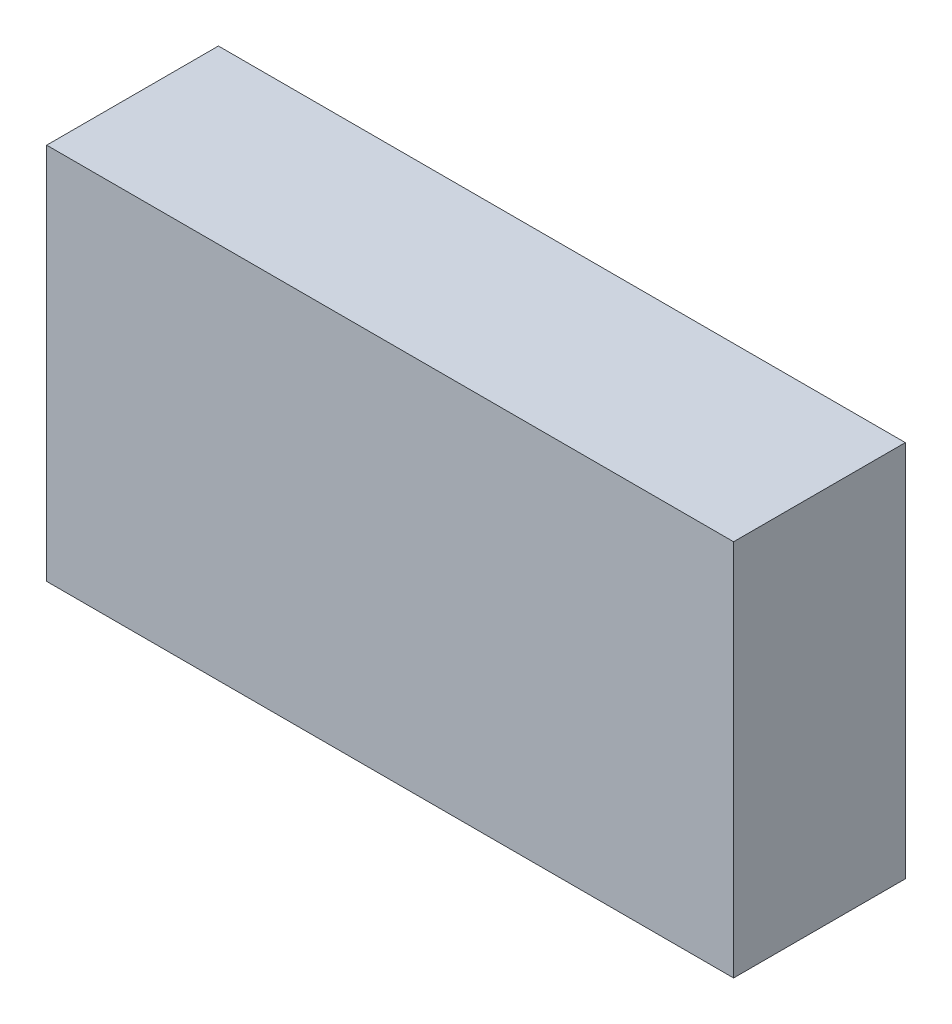
ISO-10303-21;
HEADER;
FILE_DESCRIPTION(('STEP AP214'),'2;1');
FILE_NAME('part.step','',(''),(''),'','','');
FILE_SCHEMA(('AUTOMOTIVE_DESIGN { 1 0 10303 214 1 1 1 1 }'));
ENDSEC;
DATA;
#1=APPLICATION_CONTEXT('core data for automotive mechanical design processes');
#2=APPLICATION_PROTOCOL_DEFINITION('international standard','automotive_design',2000,#1);
#3=PRODUCT_CONTEXT('',#1,'mechanical');
#4=PRODUCT('Part','Part','',(#3));
#5=PRODUCT_RELATED_PRODUCT_CATEGORY('part','',(#4));
#6=PRODUCT_DEFINITION_FORMATION('','',#4);
#7=PRODUCT_DEFINITION_CONTEXT('part definition',#1,'design');
#8=PRODUCT_DEFINITION('design','',#6,#7);
#9=PRODUCT_DEFINITION_SHAPE('','',#8);
#10=(LENGTH_UNIT() NAMED_UNIT(*) SI_UNIT(.MILLI.,.METRE.));
#11=(NAMED_UNIT(*) PLANE_ANGLE_UNIT() SI_UNIT($,.RADIAN.));
#12=(NAMED_UNIT(*) SI_UNIT($,.STERADIAN.) SOLID_ANGLE_UNIT());
#13=UNCERTAINTY_MEASURE_WITH_UNIT(LENGTH_MEASURE(1.E-05),#10,'distance_accuracy_value','');
#14=(GEOMETRIC_REPRESENTATION_CONTEXT(3) GLOBAL_UNCERTAINTY_ASSIGNED_CONTEXT((#13)) GLOBAL_UNIT_ASSIGNED_CONTEXT((#10,
#11,#12)) REPRESENTATION_CONTEXT('',''));
#15=CARTESIAN_POINT('',(0.,0.,0.));
#16=DIRECTION('',(0.,0.,1.));
#17=DIRECTION('',(1.,0.,0.));
#18=AXIS2_PLACEMENT_3D('',#15,#16,#17);
#19=CARTESIAN_POINT('',(0.508,-0.2794,0.254));
#20=DIRECTION('',(0.,0.,-1.));
#21=DIRECTION('',(-1.,0.,0.));
#22=AXIS2_PLACEMENT_3D('',#19,#20,#21);
#23=PLANE('',#22);
#24=DIRECTION('',(1.,0.,0.));
#25=VECTOR('',#24,1.);
#26=CARTESIAN_POINT('',(0.508,0.2794,0.254));
#27=LINE('',#26,#25);
#28=CARTESIAN_POINT('',(0.508,0.2794,0.254));
#29=VERTEX_POINT('',#28);
#30=CARTESIAN_POINT('',(-0.508,0.2794,0.254));
#31=VERTEX_POINT('',#30);
#32=EDGE_CURVE('E55',#29,#31,#27,.F.);
#33=ORIENTED_EDGE('',*,*,#32,.T.);
#34=DIRECTION('',(0.,1.,0.));
#35=VECTOR('',#34,1.);
#36=CARTESIAN_POINT('',(-0.508,0.2794,0.254));
#37=LINE('',#36,#35);
#38=CARTESIAN_POINT('',(-0.508,-0.2794,0.254));
#39=VERTEX_POINT('',#38);
#40=EDGE_CURVE('E57',#31,#39,#37,.F.);
#41=ORIENTED_EDGE('',*,*,#40,.T.);
#42=DIRECTION('',(1.,0.,0.));
#43=VECTOR('',#42,1.);
#44=CARTESIAN_POINT('',(-0.508,-0.2794,0.254));
#45=LINE('',#44,#43);
#46=CARTESIAN_POINT('',(0.508,-0.2794,0.254));
#47=VERTEX_POINT('',#46);
#48=EDGE_CURVE('E20',#39,#47,#45,.T.);
#49=ORIENTED_EDGE('',*,*,#48,.T.);
#50=DIRECTION('',(0.,1.,0.));
#51=VECTOR('',#50,1.);
#52=CARTESIAN_POINT('',(0.508,-0.2794,0.254));
#53=LINE('',#52,#51);
#54=EDGE_CURVE('E80',#47,#29,#53,.T.);
#55=ORIENTED_EDGE('',*,*,#54,.T.);
#56=EDGE_LOOP('',(#33,#41,#49,#55));
#57=FACE_BOUND('',#56,.T.);
#58=ADVANCED_FACE('F17',(#57),#23,.F.);
#59=CARTESIAN_POINT('',(-0.508,-0.2794,0.));
#60=DIRECTION('',(0.,1.,0.));
#61=DIRECTION('',(0.,0.,1.));
#62=AXIS2_PLACEMENT_3D('',#59,#60,#61);
#63=PLANE('',#62);
#64=DIRECTION('',(0.,0.,1.));
#65=VECTOR('',#64,1.);
#66=CARTESIAN_POINT('',(0.508,-0.2794,0.));
#67=LINE('',#66,#65);
#68=CARTESIAN_POINT('',(0.508,-0.2794,0.));
#69=VERTEX_POINT('',#68);
#70=EDGE_CURVE('E68',#69,#47,#67,.T.);
#71=ORIENTED_EDGE('',*,*,#70,.T.);
#72=ORIENTED_EDGE('',*,*,#48,.F.);
#73=DIRECTION('',(0.,0.,-1.));
#74=VECTOR('',#73,1.);
#75=CARTESIAN_POINT('',(-0.508,-0.2794,0.));
#76=LINE('',#75,#74);
#77=CARTESIAN_POINT('',(-0.508,-0.2794,0.));
#78=VERTEX_POINT('',#77);
#79=EDGE_CURVE('E63',#39,#78,#76,.T.);
#80=ORIENTED_EDGE('',*,*,#79,.T.);
#81=DIRECTION('',(-1.,0.,0.));
#82=VECTOR('',#81,1.);
#83=CARTESIAN_POINT('',(0.508,-0.2794,0.));
#84=LINE('',#83,#82);
#85=EDGE_CURVE('E83',#69,#78,#84,.T.);
#86=ORIENTED_EDGE('',*,*,#85,.F.);
#87=EDGE_LOOP('',(#71,#72,#80,#86));
#88=FACE_BOUND('',#87,.T.);
#89=ADVANCED_FACE('F65',(#88),#63,.F.);
#90=CARTESIAN_POINT('',(-0.508,0.2794,0.));
#91=DIRECTION('',(1.,0.,0.));
#92=DIRECTION('',(0.,0.,-1.));
#93=AXIS2_PLACEMENT_3D('',#90,#91,#92);
#94=PLANE('',#93);
#95=ORIENTED_EDGE('',*,*,#79,.F.);
#96=ORIENTED_EDGE('',*,*,#40,.F.);
#97=DIRECTION('',(0.,0.,-1.));
#98=VECTOR('',#97,1.);
#99=CARTESIAN_POINT('',(-0.508,0.2794,0.));
#100=LINE('',#99,#98);
#101=CARTESIAN_POINT('',(-0.508,0.2794,0.));
#102=VERTEX_POINT('',#101);
#103=EDGE_CURVE('E75',#31,#102,#100,.T.);
#104=ORIENTED_EDGE('',*,*,#103,.T.);
#105=DIRECTION('',(0.,1.,0.));
#106=VECTOR('',#105,1.);
#107=CARTESIAN_POINT('',(-0.508,-0.2794,0.));
#108=LINE('',#107,#106);
#109=EDGE_CURVE('E72',#78,#102,#108,.T.);
#110=ORIENTED_EDGE('',*,*,#109,.F.);
#111=EDGE_LOOP('',(#95,#96,#104,#110));
#112=FACE_BOUND('',#111,.T.);
#113=ADVANCED_FACE('F70',(#112),#94,.F.);
#114=CARTESIAN_POINT('',(0.508,0.2794,0.));
#115=DIRECTION('',(0.,-1.,0.));
#116=DIRECTION('',(0.,0.,-1.));
#117=AXIS2_PLACEMENT_3D('',#114,#115,#116);
#118=PLANE('',#117);
#119=ORIENTED_EDGE('',*,*,#103,.F.);
#120=ORIENTED_EDGE('',*,*,#32,.F.);
#121=DIRECTION('',(0.,0.,1.));
#122=VECTOR('',#121,1.);
#123=CARTESIAN_POINT('',(0.508,0.2794,0.));
#124=LINE('',#123,#122);
#125=CARTESIAN_POINT('',(0.508,0.2794,0.));
#126=VERTEX_POINT('',#125);
#127=EDGE_CURVE('E35',#29,#126,#124,.F.);
#128=ORIENTED_EDGE('',*,*,#127,.T.);
#129=DIRECTION('',(-1.,0.,0.));
#130=VECTOR('',#129,1.);
#131=CARTESIAN_POINT('',(0.508,0.2794,0.));
#132=LINE('',#131,#130);
#133=EDGE_CURVE('E26',#102,#126,#132,.F.);
#134=ORIENTED_EDGE('',*,*,#133,.F.);
#135=EDGE_LOOP('',(#119,#120,#128,#134));
#136=FACE_BOUND('',#135,.T.);
#137=ADVANCED_FACE('F89',(#136),#118,.F.);
#138=CARTESIAN_POINT('',(0.508,-0.2794,0.));
#139=DIRECTION('',(-1.,0.,0.));
#140=DIRECTION('',(0.,0.,1.));
#141=AXIS2_PLACEMENT_3D('',#138,#139,#140);
#142=PLANE('',#141);
#143=ORIENTED_EDGE('',*,*,#127,.F.);
#144=ORIENTED_EDGE('',*,*,#54,.F.);
#145=ORIENTED_EDGE('',*,*,#70,.F.);
#146=DIRECTION('',(0.,1.,0.));
#147=VECTOR('',#146,1.);
#148=CARTESIAN_POINT('',(0.508,-0.2794,0.));
#149=LINE('',#148,#147);
#150=EDGE_CURVE('E11',#126,#69,#149,.F.);
#151=ORIENTED_EDGE('',*,*,#150,.F.);
#152=EDGE_LOOP('',(#143,#144,#145,#151));
#153=FACE_BOUND('',#152,.T.);
#154=ADVANCED_FACE('F91',(#153),#142,.F.);
#155=CARTESIAN_POINT('',(0.508,-0.2794,0.));
#156=DIRECTION('',(0.,0.,-1.));
#157=DIRECTION('',(-1.,0.,0.));
#158=AXIS2_PLACEMENT_3D('',#155,#156,#157);
#159=PLANE('',#158);
#160=ORIENTED_EDGE('',*,*,#133,.T.);
#161=ORIENTED_EDGE('',*,*,#150,.T.);
#162=ORIENTED_EDGE('',*,*,#85,.T.);
#163=ORIENTED_EDGE('',*,*,#109,.T.);
#164=EDGE_LOOP('',(#160,#161,#162,#163));
#165=FACE_BOUND('',#164,.T.);
#166=ADVANCED_FACE('F88',(#165),#159,.T.);
#167=CLOSED_SHELL('',(#58,#89,#113,#137,#154,#166));
#168=MANIFOLD_SOLID_BREP('B1',#167);
#169=ADVANCED_BREP_SHAPE_REPRESENTATION('',(#18,#168),#14);
#170=SHAPE_DEFINITION_REPRESENTATION(#9,#169);
ENDSEC;
END-ISO-10303-21;
